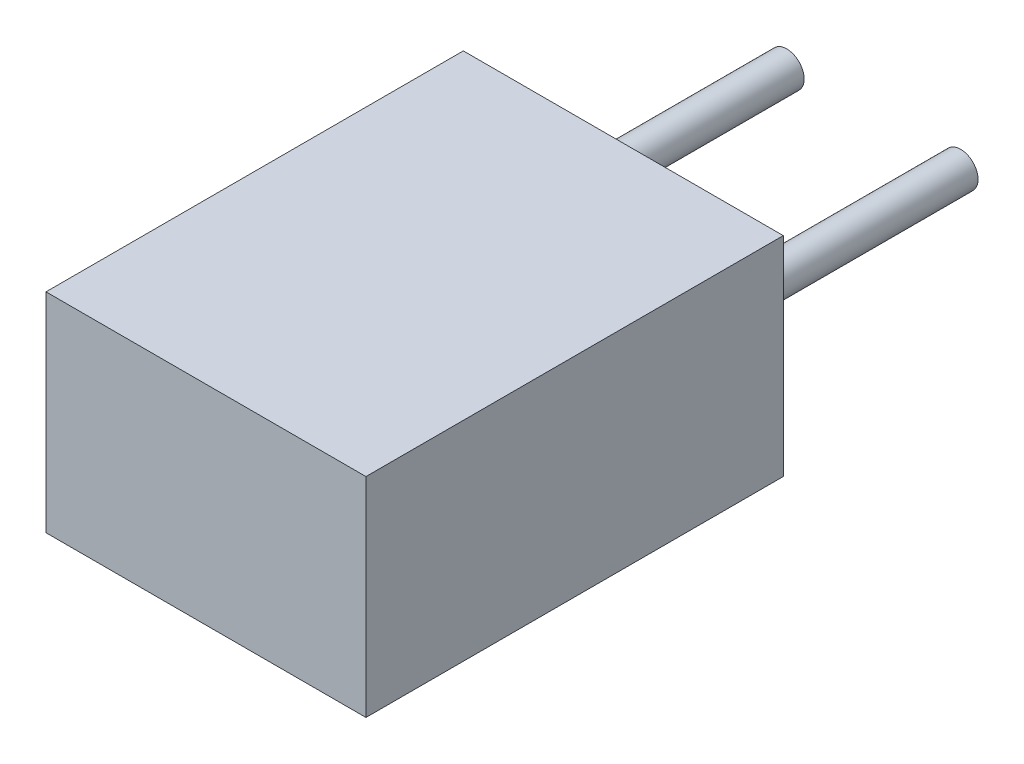
ISO-10303-21;
HEADER;
FILE_DESCRIPTION(('STEP AP214'),'2;1');
FILE_NAME('part.step','',(''),(''),'','','');
FILE_SCHEMA(('AUTOMOTIVE_DESIGN { 1 0 10303 214 1 1 1 1 }'));
ENDSEC;
DATA;
#1=APPLICATION_CONTEXT('core data for automotive mechanical design processes');
#2=APPLICATION_PROTOCOL_DEFINITION('international standard','automotive_design',2000,#1);
#3=PRODUCT_CONTEXT('',#1,'mechanical');
#4=PRODUCT('Part','Part','',(#3));
#5=PRODUCT_RELATED_PRODUCT_CATEGORY('part','',(#4));
#6=PRODUCT_DEFINITION_FORMATION('','',#4);
#7=PRODUCT_DEFINITION_CONTEXT('part definition',#1,'design');
#8=PRODUCT_DEFINITION('design','',#6,#7);
#9=PRODUCT_DEFINITION_SHAPE('','',#8);
#10=(LENGTH_UNIT() NAMED_UNIT(*) SI_UNIT(.MILLI.,.METRE.));
#11=(NAMED_UNIT(*) PLANE_ANGLE_UNIT() SI_UNIT($,.RADIAN.));
#12=(NAMED_UNIT(*) SI_UNIT($,.STERADIAN.) SOLID_ANGLE_UNIT());
#13=UNCERTAINTY_MEASURE_WITH_UNIT(LENGTH_MEASURE(1.E-05),#10,'distance_accuracy_value','');
#14=(GEOMETRIC_REPRESENTATION_CONTEXT(3) GLOBAL_UNCERTAINTY_ASSIGNED_CONTEXT((#13)) GLOBAL_UNIT_ASSIGNED_CONTEXT((#10,
#11,#12)) REPRESENTATION_CONTEXT('',''));
#15=CARTESIAN_POINT('',(0.,0.,0.));
#16=DIRECTION('',(0.,0.,1.));
#17=DIRECTION('',(1.,0.,0.));
#18=AXIS2_PLACEMENT_3D('',#15,#16,#17);
#19=CARTESIAN_POINT('',(2.3,-1.5,6.));
#20=DIRECTION('',(-1.,0.,0.));
#21=DIRECTION('',(0.,0.,1.));
#22=AXIS2_PLACEMENT_3D('',#19,#20,#21);
#23=PLANE('',#22);
#24=DIRECTION('',(0.,1.,0.));
#25=VECTOR('',#24,1.);
#26=CARTESIAN_POINT('',(2.3,-1.5,0.));
#27=LINE('',#26,#25);
#28=CARTESIAN_POINT('',(2.3,-1.5,0.));
#29=VERTEX_POINT('',#28);
#30=CARTESIAN_POINT('',(2.3,1.5,0.));
#31=VERTEX_POINT('',#30);
#32=EDGE_CURVE('E109',#29,#31,#27,.T.);
#33=ORIENTED_EDGE('',*,*,#32,.T.);
#34=DIRECTION('',(0.,0.,-1.));
#35=VECTOR('',#34,1.);
#36=CARTESIAN_POINT('',(2.3,1.5,6.));
#37=LINE('',#36,#35);
#38=CARTESIAN_POINT('',(2.3,1.5,6.));
#39=VERTEX_POINT('',#38);
#40=EDGE_CURVE('E11',#39,#31,#37,.T.);
#41=ORIENTED_EDGE('',*,*,#40,.F.);
#42=DIRECTION('',(0.,1.,0.));
#43=VECTOR('',#42,1.);
#44=CARTESIAN_POINT('',(2.3,-1.5,6.));
#45=LINE('',#44,#43);
#46=CARTESIAN_POINT('',(2.3,-1.5,6.));
#47=VERTEX_POINT('',#46);
#48=EDGE_CURVE('E93',#47,#39,#45,.T.);
#49=ORIENTED_EDGE('',*,*,#48,.F.);
#50=DIRECTION('',(0.,0.,-1.));
#51=VECTOR('',#50,1.);
#52=CARTESIAN_POINT('',(2.3,-1.5,6.));
#53=LINE('',#52,#51);
#54=EDGE_CURVE('E105',#47,#29,#53,.T.);
#55=ORIENTED_EDGE('',*,*,#54,.T.);
#56=EDGE_LOOP('',(#33,#41,#49,#55));
#57=FACE_BOUND('',#56,.T.);
#58=ADVANCED_FACE('F41',(#57),#23,.F.);
#59=CARTESIAN_POINT('',(-2.3,1.5,6.));
#60=DIRECTION('',(0.,-1.,0.));
#61=DIRECTION('',(0.,0.,-1.));
#62=AXIS2_PLACEMENT_3D('',#59,#60,#61);
#63=PLANE('',#62);
#64=DIRECTION('',(-1.,0.,0.));
#65=VECTOR('',#64,1.);
#66=CARTESIAN_POINT('',(-2.3,1.5,0.));
#67=LINE('',#66,#65);
#68=CARTESIAN_POINT('',(-2.3,1.5,0.));
#69=VERTEX_POINT('',#68);
#70=EDGE_CURVE('E98',#31,#69,#67,.T.);
#71=ORIENTED_EDGE('',*,*,#70,.T.);
#72=DIRECTION('',(0.,0.,-1.));
#73=VECTOR('',#72,1.);
#74=CARTESIAN_POINT('',(-2.3,1.5,6.));
#75=LINE('',#74,#73);
#76=CARTESIAN_POINT('',(-2.3,1.5,6.));
#77=VERTEX_POINT('',#76);
#78=EDGE_CURVE('E50',#77,#69,#75,.T.);
#79=ORIENTED_EDGE('',*,*,#78,.F.);
#80=DIRECTION('',(-1.,0.,0.));
#81=VECTOR('',#80,1.);
#82=CARTESIAN_POINT('',(-2.3,1.5,6.));
#83=LINE('',#82,#81);
#84=EDGE_CURVE('E88',#39,#77,#83,.T.);
#85=ORIENTED_EDGE('',*,*,#84,.F.);
#86=ORIENTED_EDGE('',*,*,#40,.T.);
#87=EDGE_LOOP('',(#71,#79,#85,#86));
#88=FACE_BOUND('',#87,.T.);
#89=ADVANCED_FACE('F97',(#88),#63,.F.);
#90=CARTESIAN_POINT('',(-2.3,-1.5,6.));
#91=DIRECTION('',(1.,0.,0.));
#92=DIRECTION('',(0.,0.,-1.));
#93=AXIS2_PLACEMENT_3D('',#90,#91,#92);
#94=PLANE('',#93);
#95=DIRECTION('',(0.,-1.,0.));
#96=VECTOR('',#95,1.);
#97=CARTESIAN_POINT('',(-2.3,-1.5,0.));
#98=LINE('',#97,#96);
#99=CARTESIAN_POINT('',(-2.3,-1.5,0.));
#100=VERTEX_POINT('',#99);
#101=EDGE_CURVE('E75',#69,#100,#98,.T.);
#102=ORIENTED_EDGE('',*,*,#101,.T.);
#103=DIRECTION('',(0.,0.,-1.));
#104=VECTOR('',#103,1.);
#105=CARTESIAN_POINT('',(-2.3,-1.5,6.));
#106=LINE('',#105,#104);
#107=CARTESIAN_POINT('',(-2.3,-1.5,6.));
#108=VERTEX_POINT('',#107);
#109=EDGE_CURVE('E100',#108,#100,#106,.T.);
#110=ORIENTED_EDGE('',*,*,#109,.F.);
#111=DIRECTION('',(0.,-1.,0.));
#112=VECTOR('',#111,1.);
#113=CARTESIAN_POINT('',(-2.3,-1.5,6.));
#114=LINE('',#113,#112);
#115=EDGE_CURVE('E91',#77,#108,#114,.T.);
#116=ORIENTED_EDGE('',*,*,#115,.F.);
#117=ORIENTED_EDGE('',*,*,#78,.T.);
#118=EDGE_LOOP('',(#102,#110,#116,#117));
#119=FACE_BOUND('',#118,.T.);
#120=ADVANCED_FACE('F101',(#119),#94,.F.);
#121=CARTESIAN_POINT('',(-2.3,-1.5,6.));
#122=DIRECTION('',(0.,1.,0.));
#123=DIRECTION('',(0.,0.,1.));
#124=AXIS2_PLACEMENT_3D('',#121,#122,#123);
#125=PLANE('',#124);
#126=DIRECTION('',(1.,0.,0.));
#127=VECTOR('',#126,1.);
#128=CARTESIAN_POINT('',(-2.3,-1.5,0.));
#129=LINE('',#128,#127);
#130=EDGE_CURVE('E81',#100,#29,#129,.T.);
#131=ORIENTED_EDGE('',*,*,#130,.T.);
#132=ORIENTED_EDGE('',*,*,#54,.F.);
#133=DIRECTION('',(1.,0.,0.));
#134=VECTOR('',#133,1.);
#135=CARTESIAN_POINT('',(-2.3,-1.5,6.));
#136=LINE('',#135,#134);
#137=EDGE_CURVE('E58',#108,#47,#136,.T.);
#138=ORIENTED_EDGE('',*,*,#137,.F.);
#139=ORIENTED_EDGE('',*,*,#109,.T.);
#140=EDGE_LOOP('',(#131,#132,#138,#139));
#141=FACE_BOUND('',#140,.T.);
#142=ADVANCED_FACE('F123',(#141),#125,.F.);
#143=CARTESIAN_POINT('',(0.,0.,6.));
#144=DIRECTION('',(0.,0.,-1.));
#145=DIRECTION('',(-1.,0.,0.));
#146=AXIS2_PLACEMENT_3D('',#143,#144,#145);
#147=PLANE('',#146);
#148=ORIENTED_EDGE('',*,*,#48,.T.);
#149=ORIENTED_EDGE('',*,*,#84,.T.);
#150=ORIENTED_EDGE('',*,*,#115,.T.);
#151=ORIENTED_EDGE('',*,*,#137,.T.);
#152=EDGE_LOOP('',(#148,#149,#150,#151));
#153=FACE_BOUND('',#152,.T.);
#154=ADVANCED_FACE('F89',(#153),#147,.F.);
#155=CARTESIAN_POINT('',(0.,0.,0.));
#156=DIRECTION('',(0.,0.,-1.));
#157=DIRECTION('',(-1.,0.,0.));
#158=AXIS2_PLACEMENT_3D('',#155,#156,#157);
#159=PLANE('',#158);
#160=CARTESIAN_POINT('',(-1.25,0.,0.));
#161=DIRECTION('',(0.,0.,-1.));
#162=DIRECTION('',(-1.,0.,0.));
#163=AXIS2_PLACEMENT_3D('',#160,#161,#162);
#164=CIRCLE('',#163,0.25);
#165=CARTESIAN_POINT('',(-1.5,0.,0.));
#166=VERTEX_POINT('',#165);
#167=EDGE_CURVE('E138',#166,#166,#164,.T.);
#168=ORIENTED_EDGE('',*,*,#167,.F.);
#169=EDGE_LOOP('',(#168));
#170=FACE_BOUND('',#169,.T.);
#171=CARTESIAN_POINT('',(1.25,0.,0.));
#172=DIRECTION('',(0.,0.,-1.));
#173=DIRECTION('',(-1.,0.,0.));
#174=AXIS2_PLACEMENT_3D('',#171,#172,#173);
#175=CIRCLE('',#174,0.25);
#176=CARTESIAN_POINT('',(1.,0.,0.));
#177=VERTEX_POINT('',#176);
#178=EDGE_CURVE('E130',#177,#177,#175,.T.);
#179=ORIENTED_EDGE('',*,*,#178,.F.);
#180=EDGE_LOOP('',(#179));
#181=FACE_BOUND('',#180,.T.);
#182=ORIENTED_EDGE('',*,*,#32,.F.);
#183=ORIENTED_EDGE('',*,*,#130,.F.);
#184=ORIENTED_EDGE('',*,*,#101,.F.);
#185=ORIENTED_EDGE('',*,*,#70,.F.);
#186=EDGE_LOOP('',(#182,#183,#184,#185));
#187=FACE_BOUND('',#186,.T.);
#188=ADVANCED_FACE('F126',(#170,#181,#187),#159,.T.);
#189=CARTESIAN_POINT('',(1.25,0.,-3.6));
#190=DIRECTION('',(0.,0.,1.));
#191=DIRECTION('',(1.,0.,0.));
#192=AXIS2_PLACEMENT_3D('',#189,#190,#191);
#193=CYLINDRICAL_SURFACE('',#192,0.25);
#194=CARTESIAN_POINT('',(1.25,0.,-3.6));
#195=DIRECTION('',(0.,0.,-1.));
#196=DIRECTION('',(-1.,0.,0.));
#197=AXIS2_PLACEMENT_3D('',#194,#195,#196);
#198=CIRCLE('',#197,0.25);
#199=CARTESIAN_POINT('',(1.,0.,-3.6));
#200=VERTEX_POINT('',#199);
#201=EDGE_CURVE('E113',#200,#200,#198,.T.);
#202=ORIENTED_EDGE('',*,*,#201,.F.);
#203=EDGE_LOOP('',(#202));
#204=FACE_BOUND('',#203,.T.);
#205=ORIENTED_EDGE('',*,*,#178,.T.);
#206=EDGE_LOOP('',(#205));
#207=FACE_BOUND('',#206,.T.);
#208=ADVANCED_FACE('F157',(#204,#207),#193,.T.);
#209=CARTESIAN_POINT('',(1.25,0.,-3.6));
#210=DIRECTION('',(0.,0.,-1.));
#211=DIRECTION('',(-1.,0.,0.));
#212=AXIS2_PLACEMENT_3D('',#209,#210,#211);
#213=PLANE('',#212);
#214=ORIENTED_EDGE('',*,*,#201,.T.);
#215=EDGE_LOOP('',(#214));
#216=FACE_BOUND('',#215,.T.);
#217=ADVANCED_FACE('F151',(#216),#213,.T.);
#218=CARTESIAN_POINT('',(-1.25,0.,-3.6));
#219=DIRECTION('',(0.,0.,1.));
#220=DIRECTION('',(1.,0.,0.));
#221=AXIS2_PLACEMENT_3D('',#218,#219,#220);
#222=CYLINDRICAL_SURFACE('',#221,0.25);
#223=CARTESIAN_POINT('',(-1.25,0.,-3.6));
#224=DIRECTION('',(0.,0.,-1.));
#225=DIRECTION('',(-1.,0.,0.));
#226=AXIS2_PLACEMENT_3D('',#223,#224,#225);
#227=CIRCLE('',#226,0.25);
#228=CARTESIAN_POINT('',(-1.5,0.,-3.6));
#229=VERTEX_POINT('',#228);
#230=EDGE_CURVE('E134',#229,#229,#227,.T.);
#231=ORIENTED_EDGE('',*,*,#230,.F.);
#232=EDGE_LOOP('',(#231));
#233=FACE_BOUND('',#232,.T.);
#234=ORIENTED_EDGE('',*,*,#167,.T.);
#235=EDGE_LOOP('',(#234));
#236=FACE_BOUND('',#235,.T.);
#237=ADVANCED_FACE('F148',(#233,#236),#222,.T.);
#238=CARTESIAN_POINT('',(-1.25,0.,-3.6));
#239=DIRECTION('',(0.,0.,-1.));
#240=DIRECTION('',(-1.,0.,0.));
#241=AXIS2_PLACEMENT_3D('',#238,#239,#240);
#242=PLANE('',#241);
#243=ORIENTED_EDGE('',*,*,#230,.T.);
#244=EDGE_LOOP('',(#243));
#245=FACE_BOUND('',#244,.T.);
#246=ADVANCED_FACE('F146',(#245),#242,.T.);
#247=CLOSED_SHELL('',(#58,#89,#120,#142,#154,#188,#208,#217,#237,#246));
#248=MANIFOLD_SOLID_BREP('B2',#247);
#249=ADVANCED_BREP_SHAPE_REPRESENTATION('',(#18,#248),#14);
#250=SHAPE_DEFINITION_REPRESENTATION(#9,#249);
ENDSEC;
END-ISO-10303-21;
